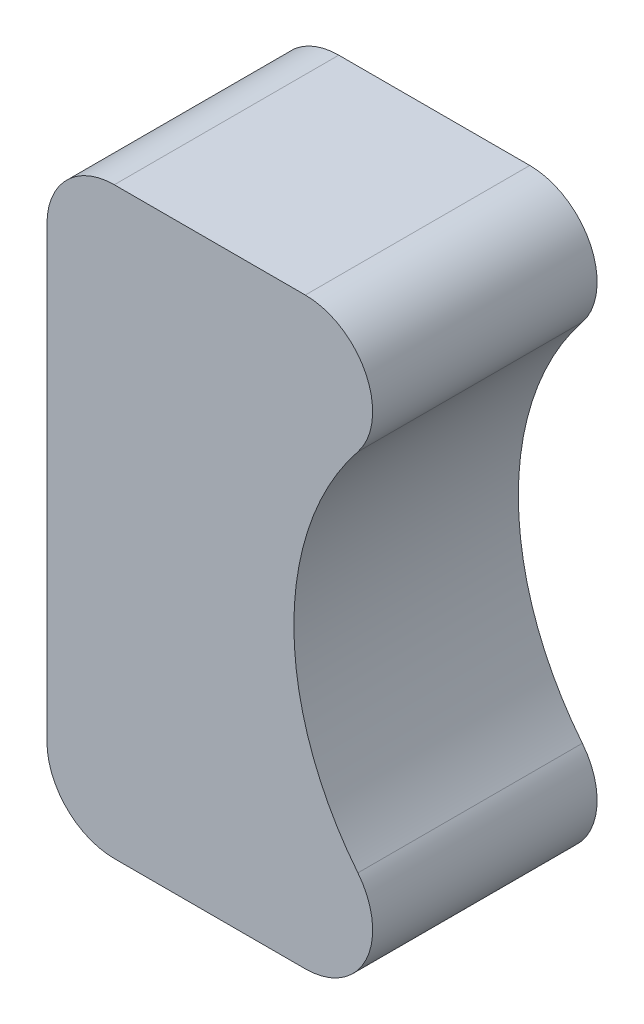
ISO-10303-21;
HEADER;
FILE_DESCRIPTION(('STEP AP214'),'2;1');
FILE_NAME('part.step','',(''),(''),'','','');
FILE_SCHEMA(('AUTOMOTIVE_DESIGN { 1 0 10303 214 1 1 1 1 }'));
ENDSEC;
DATA;
#1=APPLICATION_CONTEXT('core data for automotive mechanical design processes');
#2=APPLICATION_PROTOCOL_DEFINITION('international standard','automotive_design',2000,#1);
#3=PRODUCT_CONTEXT('',#1,'mechanical');
#4=PRODUCT('Part','Part','',(#3));
#5=PRODUCT_RELATED_PRODUCT_CATEGORY('part','',(#4));
#6=PRODUCT_DEFINITION_FORMATION('','',#4);
#7=PRODUCT_DEFINITION_CONTEXT('part definition',#1,'design');
#8=PRODUCT_DEFINITION('design','',#6,#7);
#9=PRODUCT_DEFINITION_SHAPE('','',#8);
#10=(LENGTH_UNIT() NAMED_UNIT(*) SI_UNIT(.MILLI.,.METRE.));
#11=(NAMED_UNIT(*) PLANE_ANGLE_UNIT() SI_UNIT($,.RADIAN.));
#12=(NAMED_UNIT(*) SI_UNIT($,.STERADIAN.) SOLID_ANGLE_UNIT());
#13=UNCERTAINTY_MEASURE_WITH_UNIT(LENGTH_MEASURE(1.E-05),#10,'distance_accuracy_value','');
#14=(GEOMETRIC_REPRESENTATION_CONTEXT(3) GLOBAL_UNCERTAINTY_ASSIGNED_CONTEXT((#13)) GLOBAL_UNIT_ASSIGNED_CONTEXT((#10,
#11,#12)) REPRESENTATION_CONTEXT('',''));
#15=CARTESIAN_POINT('',(0.,0.,0.));
#16=DIRECTION('',(0.,0.,1.));
#17=DIRECTION('',(1.,0.,0.));
#18=AXIS2_PLACEMENT_3D('',#15,#16,#17);
#19=CARTESIAN_POINT('',(0.,0.,5.));
#20=DIRECTION('',(1.,0.,0.));
#21=DIRECTION('',(0.,0.,-1.));
#22=AXIS2_PLACEMENT_3D('',#19,#20,#21);
#23=PLANE('',#22);
#24=CARTESIAN_POINT('',(0.,6.5,2.5));
#25=DIRECTION('',(-1.,0.,0.));
#26=DIRECTION('',(0.,0.,1.));
#27=AXIS2_PLACEMENT_3D('',#24,#25,#26);
#28=CIRCLE('',#27,1.75);
#29=CARTESIAN_POINT('',(0.,6.5,4.25));
#30=VERTEX_POINT('',#29);
#31=EDGE_CURVE('E178',#30,#30,#28,.T.);
#32=ORIENTED_EDGE('',*,*,#31,.F.);
#33=EDGE_LOOP('',(#32));
#34=FACE_BOUND('',#33,.T.);
#35=DIRECTION('',(0.,-1.,0.));
#36=VECTOR('',#35,1.);
#37=CARTESIAN_POINT('',(0.,0.,0.));
#38=LINE('',#37,#36);
#39=CARTESIAN_POINT('',(0.,11.5,0.));
#40=VERTEX_POINT('',#39);
#41=CARTESIAN_POINT('',(0.,1.5,0.));
#42=VERTEX_POINT('',#41);
#43=EDGE_CURVE('E170',#40,#42,#38,.T.);
#44=ORIENTED_EDGE('',*,*,#43,.T.);
#45=DIRECTION('',(0.,0.,-1.));
#46=VECTOR('',#45,1.);
#47=CARTESIAN_POINT('',(0.,1.5,5.));
#48=LINE('',#47,#46);
#49=CARTESIAN_POINT('',(0.,1.5,5.));
#50=VERTEX_POINT('',#49);
#51=EDGE_CURVE('E57',#42,#50,#48,.F.);
#52=ORIENTED_EDGE('',*,*,#51,.T.);
#53=DIRECTION('',(0.,-1.,0.));
#54=VECTOR('',#53,1.);
#55=CARTESIAN_POINT('',(0.,0.,5.));
#56=LINE('',#55,#54);
#57=CARTESIAN_POINT('',(0.,11.5,5.));
#58=VERTEX_POINT('',#57);
#59=EDGE_CURVE('E162',#58,#50,#56,.T.);
#60=ORIENTED_EDGE('',*,*,#59,.F.);
#61=DIRECTION('',(0.,0.,-1.));
#62=VECTOR('',#61,1.);
#63=CARTESIAN_POINT('',(0.,11.5,5.));
#64=LINE('',#63,#62);
#65=EDGE_CURVE('E153',#58,#40,#64,.T.);
#66=ORIENTED_EDGE('',*,*,#65,.T.);
#67=EDGE_LOOP('',(#44,#52,#60,#66));
#68=FACE_BOUND('',#67,.T.);
#69=ADVANCED_FACE('F36',(#34,#68),#23,.F.);
#70=CARTESIAN_POINT('',(0.,0.,5.));
#71=DIRECTION('',(0.,1.,0.));
#72=DIRECTION('',(0.,0.,1.));
#73=AXIS2_PLACEMENT_3D('',#70,#71,#72);
#74=PLANE('',#73);
#75=DIRECTION('',(1.,0.,0.));
#76=VECTOR('',#75,1.);
#77=CARTESIAN_POINT('',(0.,0.,5.));
#78=LINE('',#77,#76);
#79=CARTESIAN_POINT('',(1.5,0.,5.));
#80=VERTEX_POINT('',#79);
#81=CARTESIAN_POINT('',(5.7550020016016,0.,5.));
#82=VERTEX_POINT('',#81);
#83=EDGE_CURVE('E131',#80,#82,#78,.T.);
#84=ORIENTED_EDGE('',*,*,#83,.F.);
#85=DIRECTION('',(0.,0.,-1.));
#86=VECTOR('',#85,1.);
#87=CARTESIAN_POINT('',(1.5,0.,5.));
#88=LINE('',#87,#86);
#89=CARTESIAN_POINT('',(1.5,0.,0.));
#90=VERTEX_POINT('',#89);
#91=EDGE_CURVE('E146',#80,#90,#88,.T.);
#92=ORIENTED_EDGE('',*,*,#91,.T.);
#93=DIRECTION('',(1.,0.,0.));
#94=VECTOR('',#93,1.);
#95=CARTESIAN_POINT('',(0.,0.,0.));
#96=LINE('',#95,#94);
#97=CARTESIAN_POINT('',(5.7550020016016,0.,0.));
#98=VERTEX_POINT('',#97);
#99=EDGE_CURVE('E171',#90,#98,#96,.T.);
#100=ORIENTED_EDGE('',*,*,#99,.T.);
#101=DIRECTION('',(0.,0.,1.));
#102=VECTOR('',#101,1.);
#103=CARTESIAN_POINT('',(5.7550020016016,0.,5.));
#104=LINE('',#103,#102);
#105=EDGE_CURVE('E110',#98,#82,#104,.T.);
#106=ORIENTED_EDGE('',*,*,#105,.T.);
#107=EDGE_LOOP('',(#84,#92,#100,#106));
#108=FACE_BOUND('',#107,.T.);
#109=ADVANCED_FACE('F166',(#108),#74,.F.);
#110=CARTESIAN_POINT('',(0.,13.,5.));
#111=DIRECTION('',(0.,-1.,0.));
#112=DIRECTION('',(0.,0.,-1.));
#113=AXIS2_PLACEMENT_3D('',#110,#111,#112);
#114=PLANE('',#113);
#115=DIRECTION('',(-1.,0.,0.));
#116=VECTOR('',#115,1.);
#117=CARTESIAN_POINT('',(0.,13.,0.));
#118=LINE('',#117,#116);
#119=CARTESIAN_POINT('',(5.75500200160161,13.,0.));
#120=VERTEX_POINT('',#119);
#121=CARTESIAN_POINT('',(1.5,13.,0.));
#122=VERTEX_POINT('',#121);
#123=EDGE_CURVE('E134',#120,#122,#118,.T.);
#124=ORIENTED_EDGE('',*,*,#123,.T.);
#125=DIRECTION('',(0.,0.,-1.));
#126=VECTOR('',#125,1.);
#127=CARTESIAN_POINT('',(1.5,13.,5.));
#128=LINE('',#127,#126);
#129=CARTESIAN_POINT('',(1.5,13.,5.));
#130=VERTEX_POINT('',#129);
#131=EDGE_CURVE('E11',#122,#130,#128,.F.);
#132=ORIENTED_EDGE('',*,*,#131,.T.);
#133=DIRECTION('',(-1.,0.,0.));
#134=VECTOR('',#133,1.);
#135=CARTESIAN_POINT('',(0.,13.,5.));
#136=LINE('',#135,#134);
#137=CARTESIAN_POINT('',(5.75500200160161,13.,5.));
#138=VERTEX_POINT('',#137);
#139=EDGE_CURVE('E128',#138,#130,#136,.T.);
#140=ORIENTED_EDGE('',*,*,#139,.F.);
#141=DIRECTION('',(0.,0.,1.));
#142=VECTOR('',#141,1.);
#143=CARTESIAN_POINT('',(5.75500200160161,13.,5.));
#144=LINE('',#143,#142);
#145=EDGE_CURVE('E143',#138,#120,#144,.F.);
#146=ORIENTED_EDGE('',*,*,#145,.T.);
#147=EDGE_LOOP('',(#124,#132,#140,#146));
#148=FACE_BOUND('',#147,.T.);
#149=ADVANCED_FACE('F197',(#148),#114,.F.);
#150=CARTESIAN_POINT('',(0.,0.,5.));
#151=DIRECTION('',(0.,0.,-1.));
#152=DIRECTION('',(-1.,0.,0.));
#153=AXIS2_PLACEMENT_3D('',#150,#151,#152);
#154=PLANE('',#153);
#155=ORIENTED_EDGE('',*,*,#59,.T.);
#156=CARTESIAN_POINT('',(1.5,1.5,5.));
#157=DIRECTION('',(0.,0.,-1.));
#158=DIRECTION('',(-1.,0.,0.));
#159=AXIS2_PLACEMENT_3D('',#156,#157,#158);
#160=CIRCLE('',#159,1.5);
#161=EDGE_CURVE('E44',#50,#80,#160,.F.);
#162=ORIENTED_EDGE('',*,*,#161,.T.);
#163=ORIENTED_EDGE('',*,*,#83,.T.);
#164=CARTESIAN_POINT('',(5.7550020016016,1.5,5.));
#165=DIRECTION('',(0.,0.,-1.));
#166=DIRECTION('',(-1.,0.,0.));
#167=AXIS2_PLACEMENT_3D('',#164,#165,#166);
#168=CIRCLE('',#167,1.5);
#169=CARTESIAN_POINT('',(6.9259391263013,2.4375,5.));
#170=VERTEX_POINT('',#169);
#171=EDGE_CURVE('E141',#82,#170,#168,.F.);
#172=ORIENTED_EDGE('',*,*,#171,.T.);
#173=CARTESIAN_POINT('',(12.,6.5,5.));
#174=DIRECTION('',(0.,0.,1.));
#175=DIRECTION('',(1.,0.,0.));
#176=AXIS2_PLACEMENT_3D('',#173,#174,#175);
#177=CIRCLE('',#176,6.5);
#178=CARTESIAN_POINT('',(6.92593912630131,10.5625,5.));
#179=VERTEX_POINT('',#178);
#180=EDGE_CURVE('E123',#179,#170,#177,.T.);
#181=ORIENTED_EDGE('',*,*,#180,.F.);
#182=CARTESIAN_POINT('',(5.75500200160161,11.5,5.));
#183=DIRECTION('',(0.,0.,-1.));
#184=DIRECTION('',(-1.,0.,0.));
#185=AXIS2_PLACEMENT_3D('',#182,#183,#184);
#186=CIRCLE('',#185,1.5);
#187=EDGE_CURVE('E139',#179,#138,#186,.F.);
#188=ORIENTED_EDGE('',*,*,#187,.T.);
#189=ORIENTED_EDGE('',*,*,#139,.T.);
#190=CARTESIAN_POINT('',(1.5,11.5,5.));
#191=DIRECTION('',(0.,0.,-1.));
#192=DIRECTION('',(-1.,0.,0.));
#193=AXIS2_PLACEMENT_3D('',#190,#191,#192);
#194=CIRCLE('',#193,1.5);
#195=EDGE_CURVE('E157',#130,#58,#194,.F.);
#196=ORIENTED_EDGE('',*,*,#195,.T.);
#197=EDGE_LOOP('',(#155,#162,#163,#172,#181,#188,#189,#196));
#198=FACE_BOUND('',#197,.T.);
#199=ADVANCED_FACE('F161',(#198),#154,.F.);
#200=CARTESIAN_POINT('',(0.,0.,0.));
#201=DIRECTION('',(0.,0.,-1.));
#202=DIRECTION('',(-1.,0.,0.));
#203=AXIS2_PLACEMENT_3D('',#200,#201,#202);
#204=PLANE('',#203);
#205=ORIENTED_EDGE('',*,*,#99,.F.);
#206=CARTESIAN_POINT('',(1.5,1.5,0.));
#207=DIRECTION('',(0.,0.,-1.));
#208=DIRECTION('',(-1.,0.,0.));
#209=AXIS2_PLACEMENT_3D('',#206,#207,#208);
#210=CIRCLE('',#209,1.5);
#211=EDGE_CURVE('E151',#90,#42,#210,.T.);
#212=ORIENTED_EDGE('',*,*,#211,.T.);
#213=ORIENTED_EDGE('',*,*,#43,.F.);
#214=CARTESIAN_POINT('',(1.5,11.5,0.));
#215=DIRECTION('',(0.,0.,-1.));
#216=DIRECTION('',(-1.,0.,0.));
#217=AXIS2_PLACEMENT_3D('',#214,#215,#216);
#218=CIRCLE('',#217,1.5);
#219=EDGE_CURVE('E149',#40,#122,#218,.T.);
#220=ORIENTED_EDGE('',*,*,#219,.T.);
#221=ORIENTED_EDGE('',*,*,#123,.F.);
#222=CARTESIAN_POINT('',(5.75500200160161,11.5,0.));
#223=DIRECTION('',(0.,0.,-1.));
#224=DIRECTION('',(-1.,0.,0.));
#225=AXIS2_PLACEMENT_3D('',#222,#223,#224);
#226=CIRCLE('',#225,1.5);
#227=CARTESIAN_POINT('',(6.92593912630131,10.5625,0.));
#228=VERTEX_POINT('',#227);
#229=EDGE_CURVE('E114',#120,#228,#226,.T.);
#230=ORIENTED_EDGE('',*,*,#229,.T.);
#231=CARTESIAN_POINT('',(12.,6.5,0.));
#232=DIRECTION('',(0.,0.,-1.));
#233=DIRECTION('',(-1.,0.,0.));
#234=AXIS2_PLACEMENT_3D('',#231,#232,#233);
#235=CIRCLE('',#234,6.5);
#236=CARTESIAN_POINT('',(6.9259391263013,2.4375,0.));
#237=VERTEX_POINT('',#236);
#238=EDGE_CURVE('E120',#237,#228,#235,.T.);
#239=ORIENTED_EDGE('',*,*,#238,.F.);
#240=CARTESIAN_POINT('',(5.7550020016016,1.5,0.));
#241=DIRECTION('',(0.,0.,-1.));
#242=DIRECTION('',(-1.,0.,0.));
#243=AXIS2_PLACEMENT_3D('',#240,#241,#242);
#244=CIRCLE('',#243,1.5);
#245=EDGE_CURVE('E104',#237,#98,#244,.T.);
#246=ORIENTED_EDGE('',*,*,#245,.T.);
#247=EDGE_LOOP('',(#205,#212,#213,#220,#221,#230,#239,#246));
#248=FACE_BOUND('',#247,.T.);
#249=ADVANCED_FACE('F126',(#248),#204,.T.);
#250=CARTESIAN_POINT('',(12.,6.5,-4.));
#251=DIRECTION('',(0.,0.,1.));
#252=DIRECTION('',(1.,0.,0.));
#253=AXIS2_PLACEMENT_3D('',#250,#251,#252);
#254=CYLINDRICAL_SURFACE('',#253,6.5);
#255=ORIENTED_EDGE('',*,*,#180,.T.);
#256=DIRECTION('',(0.,0.,1.));
#257=VECTOR('',#256,1.);
#258=CARTESIAN_POINT('',(6.9259391263013,2.4375,-4.));
#259=LINE('',#258,#257);
#260=EDGE_CURVE('E108',#170,#237,#259,.F.);
#261=ORIENTED_EDGE('',*,*,#260,.T.);
#262=ORIENTED_EDGE('',*,*,#238,.T.);
#263=DIRECTION('',(0.,0.,1.));
#264=VECTOR('',#263,1.);
#265=CARTESIAN_POINT('',(6.9259391263013,10.5625,-4.));
#266=LINE('',#265,#264);
#267=EDGE_CURVE('E124',#228,#179,#266,.T.);
#268=ORIENTED_EDGE('',*,*,#267,.T.);
#269=EDGE_LOOP('',(#255,#261,#262,#268));
#270=FACE_BOUND('',#269,.T.);
#271=ADVANCED_FACE('F119',(#270),#254,.F.);
#272=CARTESIAN_POINT('',(3.,6.5,2.5));
#273=DIRECTION('',(-1.,0.,0.));
#274=DIRECTION('',(0.,0.,1.));
#275=AXIS2_PLACEMENT_3D('',#272,#273,#274);
#276=CYLINDRICAL_SURFACE('',#275,1.75);
#277=CARTESIAN_POINT('',(3.,6.5,2.5));
#278=DIRECTION('',(-1.,0.,0.));
#279=DIRECTION('',(0.,0.,1.));
#280=AXIS2_PLACEMENT_3D('',#277,#278,#279);
#281=CIRCLE('',#280,1.75);
#282=CARTESIAN_POINT('',(3.,6.5,4.25));
#283=VERTEX_POINT('',#282);
#284=EDGE_CURVE('E174',#283,#283,#281,.T.);
#285=ORIENTED_EDGE('',*,*,#284,.F.);
#286=EDGE_LOOP('',(#285));
#287=FACE_BOUND('',#286,.T.);
#288=ORIENTED_EDGE('',*,*,#31,.T.);
#289=EDGE_LOOP('',(#288));
#290=FACE_BOUND('',#289,.T.);
#291=ADVANCED_FACE('F186',(#287,#290),#276,.F.);
#292=CARTESIAN_POINT('',(3.,6.5,2.5));
#293=DIRECTION('',(-1.,0.,0.));
#294=DIRECTION('',(0.,0.,1.));
#295=AXIS2_PLACEMENT_3D('',#292,#293,#294);
#296=PLANE('',#295);
#297=ORIENTED_EDGE('',*,*,#284,.T.);
#298=EDGE_LOOP('',(#297));
#299=FACE_BOUND('',#298,.T.);
#300=ADVANCED_FACE('F184',(#299),#296,.T.);
#301=CARTESIAN_POINT('',(5.7550020016016,1.5,-4.));
#302=DIRECTION('',(0.,0.,1.));
#303=DIRECTION('',(1.,0.,0.));
#304=AXIS2_PLACEMENT_3D('',#301,#302,#303);
#305=CYLINDRICAL_SURFACE('',#304,1.5);
#306=ORIENTED_EDGE('',*,*,#171,.F.);
#307=ORIENTED_EDGE('',*,*,#105,.F.);
#308=ORIENTED_EDGE('',*,*,#245,.F.);
#309=ORIENTED_EDGE('',*,*,#260,.F.);
#310=EDGE_LOOP('',(#306,#307,#308,#309));
#311=FACE_BOUND('',#310,.T.);
#312=ADVANCED_FACE('F107',(#311),#305,.T.);
#313=CARTESIAN_POINT('',(5.75500200160161,11.5,-4.));
#314=DIRECTION('',(0.,0.,1.));
#315=DIRECTION('',(1.,0.,0.));
#316=AXIS2_PLACEMENT_3D('',#313,#314,#315);
#317=CYLINDRICAL_SURFACE('',#316,1.5);
#318=ORIENTED_EDGE('',*,*,#187,.F.);
#319=ORIENTED_EDGE('',*,*,#267,.F.);
#320=ORIENTED_EDGE('',*,*,#229,.F.);
#321=ORIENTED_EDGE('',*,*,#145,.F.);
#322=EDGE_LOOP('',(#318,#319,#320,#321));
#323=FACE_BOUND('',#322,.T.);
#324=ADVANCED_FACE('F203',(#323),#317,.T.);
#325=CARTESIAN_POINT('',(1.5,1.5,5.));
#326=DIRECTION('',(0.,0.,-1.));
#327=DIRECTION('',(-1.,0.,0.));
#328=AXIS2_PLACEMENT_3D('',#325,#326,#327);
#329=CYLINDRICAL_SURFACE('',#328,1.5);
#330=ORIENTED_EDGE('',*,*,#161,.F.);
#331=ORIENTED_EDGE('',*,*,#51,.F.);
#332=ORIENTED_EDGE('',*,*,#211,.F.);
#333=ORIENTED_EDGE('',*,*,#91,.F.);
#334=EDGE_LOOP('',(#330,#331,#332,#333));
#335=FACE_BOUND('',#334,.T.);
#336=ADVANCED_FACE('F168',(#335),#329,.T.);
#337=CARTESIAN_POINT('',(1.5,11.5,5.));
#338=DIRECTION('',(0.,0.,-1.));
#339=DIRECTION('',(-1.,0.,0.));
#340=AXIS2_PLACEMENT_3D('',#337,#338,#339);
#341=CYLINDRICAL_SURFACE('',#340,1.5);
#342=ORIENTED_EDGE('',*,*,#195,.F.);
#343=ORIENTED_EDGE('',*,*,#131,.F.);
#344=ORIENTED_EDGE('',*,*,#219,.F.);
#345=ORIENTED_EDGE('',*,*,#65,.F.);
#346=EDGE_LOOP('',(#342,#343,#344,#345));
#347=FACE_BOUND('',#346,.T.);
#348=ADVANCED_FACE('F38',(#347),#341,.T.);
#349=CLOSED_SHELL('',(#69,#109,#149,#199,#249,#271,#291,#300,#312,#324,#336,#348));
#350=MANIFOLD_SOLID_BREP('B2',#349);
#351=ADVANCED_BREP_SHAPE_REPRESENTATION('',(#18,#350),#14);
#352=SHAPE_DEFINITION_REPRESENTATION(#9,#351);
ENDSEC;
END-ISO-10303-21;
